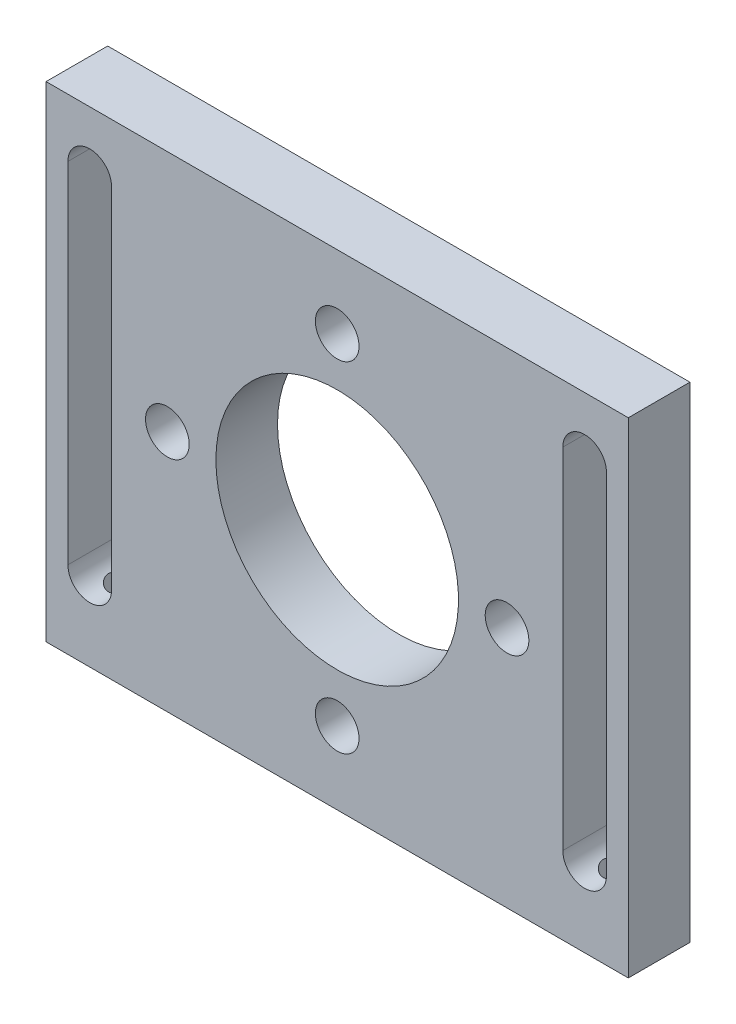
ISO-10303-21;
HEADER;
FILE_DESCRIPTION(('STEP AP214'),'2;1');
FILE_NAME('part.step','',(''),(''),'','','');
FILE_SCHEMA(('AUTOMOTIVE_DESIGN { 1 0 10303 214 1 1 1 1 }'));
ENDSEC;
DATA;
#1=APPLICATION_CONTEXT('core data for automotive mechanical design processes');
#2=APPLICATION_PROTOCOL_DEFINITION('international standard','automotive_design',2000,#1);
#3=PRODUCT_CONTEXT('',#1,'mechanical');
#4=PRODUCT('Part','Part','',(#3));
#5=PRODUCT_RELATED_PRODUCT_CATEGORY('part','',(#4));
#6=PRODUCT_DEFINITION_FORMATION('','',#4);
#7=PRODUCT_DEFINITION_CONTEXT('part definition',#1,'design');
#8=PRODUCT_DEFINITION('design','',#6,#7);
#9=PRODUCT_DEFINITION_SHAPE('','',#8);
#10=(LENGTH_UNIT() NAMED_UNIT(*) SI_UNIT(.MILLI.,.METRE.));
#11=(NAMED_UNIT(*) PLANE_ANGLE_UNIT() SI_UNIT($,.RADIAN.));
#12=(NAMED_UNIT(*) SI_UNIT($,.STERADIAN.) SOLID_ANGLE_UNIT());
#13=UNCERTAINTY_MEASURE_WITH_UNIT(LENGTH_MEASURE(1.E-05),#10,'distance_accuracy_value','');
#14=(GEOMETRIC_REPRESENTATION_CONTEXT(3) GLOBAL_UNCERTAINTY_ASSIGNED_CONTEXT((#13)) GLOBAL_UNIT_ASSIGNED_CONTEXT((#10,
#11,#12)) REPRESENTATION_CONTEXT('',''));
#15=CARTESIAN_POINT('',(0.,0.,0.));
#16=DIRECTION('',(0.,0.,1.));
#17=DIRECTION('',(1.,0.,0.));
#18=AXIS2_PLACEMENT_3D('',#15,#16,#17);
#19=CARTESIAN_POINT('',(30.,25.,6.35));
#20=DIRECTION('',(1.,0.,0.));
#21=DIRECTION('',(0.,1.,0.));
#22=AXIS2_PLACEMENT_3D('',#19,#20,#21);
#23=PLANE('',#22);
#24=DIRECTION('',(0.,-1.,0.));
#25=VECTOR('',#24,1.);
#26=CARTESIAN_POINT('',(30.,25.,0.));
#27=LINE('',#26,#25);
#28=CARTESIAN_POINT('',(30.,25.,0.));
#29=VERTEX_POINT('',#28);
#30=CARTESIAN_POINT('',(30.,-25.,0.));
#31=VERTEX_POINT('',#30);
#32=EDGE_CURVE('E189',#29,#31,#27,.T.);
#33=ORIENTED_EDGE('',*,*,#32,.F.);
#34=DIRECTION('',(0.,0.,-1.));
#35=VECTOR('',#34,1.);
#36=CARTESIAN_POINT('',(30.,25.,6.35));
#37=LINE('',#36,#35);
#38=CARTESIAN_POINT('',(30.,25.,6.35));
#39=VERTEX_POINT('',#38);
#40=EDGE_CURVE('E220',#39,#29,#37,.T.);
#41=ORIENTED_EDGE('',*,*,#40,.F.);
#42=DIRECTION('',(0.,-1.,0.));
#43=VECTOR('',#42,1.);
#44=CARTESIAN_POINT('',(30.,25.,6.35));
#45=LINE('',#44,#43);
#46=CARTESIAN_POINT('',(30.,-25.,6.35));
#47=VERTEX_POINT('',#46);
#48=EDGE_CURVE('E196',#39,#47,#45,.T.);
#49=ORIENTED_EDGE('',*,*,#48,.T.);
#50=DIRECTION('',(0.,0.,-1.));
#51=VECTOR('',#50,1.);
#52=CARTESIAN_POINT('',(30.,-25.,6.35));
#53=LINE('',#52,#51);
#54=EDGE_CURVE('E209',#47,#31,#53,.T.);
#55=ORIENTED_EDGE('',*,*,#54,.T.);
#56=EDGE_LOOP('',(#33,#41,#49,#55));
#57=FACE_BOUND('',#56,.T.);
#58=ADVANCED_FACE('F35',(#57),#23,.T.);
#59=CARTESIAN_POINT('',(-30.,25.,6.35));
#60=DIRECTION('',(0.,1.,0.));
#61=DIRECTION('',(0.,0.,1.));
#62=AXIS2_PLACEMENT_3D('',#59,#60,#61);
#63=PLANE('',#62);
#64=DIRECTION('',(1.,0.,0.));
#65=VECTOR('',#64,1.);
#66=CARTESIAN_POINT('',(-30.,25.,0.));
#67=LINE('',#66,#65);
#68=CARTESIAN_POINT('',(-30.,25.,0.));
#69=VERTEX_POINT('',#68);
#70=EDGE_CURVE('E200',#69,#29,#67,.T.);
#71=ORIENTED_EDGE('',*,*,#70,.F.);
#72=DIRECTION('',(0.,0.,-1.));
#73=VECTOR('',#72,1.);
#74=CARTESIAN_POINT('',(-30.,25.,6.35));
#75=LINE('',#74,#73);
#76=CARTESIAN_POINT('',(-30.,25.,6.35));
#77=VERTEX_POINT('',#76);
#78=EDGE_CURVE('E223',#77,#69,#75,.T.);
#79=ORIENTED_EDGE('',*,*,#78,.F.);
#80=DIRECTION('',(1.,0.,0.));
#81=VECTOR('',#80,1.);
#82=CARTESIAN_POINT('',(-30.,25.,6.35));
#83=LINE('',#82,#81);
#84=EDGE_CURVE('E206',#77,#39,#83,.T.);
#85=ORIENTED_EDGE('',*,*,#84,.T.);
#86=ORIENTED_EDGE('',*,*,#40,.T.);
#87=EDGE_LOOP('',(#71,#79,#85,#86));
#88=FACE_BOUND('',#87,.T.);
#89=ADVANCED_FACE('F264',(#88),#63,.T.);
#90=CARTESIAN_POINT('',(-30.,-25.,6.35));
#91=DIRECTION('',(-1.,0.,0.));
#92=DIRECTION('',(0.,-1.,0.));
#93=AXIS2_PLACEMENT_3D('',#90,#91,#92);
#94=PLANE('',#93);
#95=DIRECTION('',(0.,1.,0.));
#96=VECTOR('',#95,1.);
#97=CARTESIAN_POINT('',(-30.,-25.,0.));
#98=LINE('',#97,#96);
#99=CARTESIAN_POINT('',(-30.,-25.,0.));
#100=VERTEX_POINT('',#99);
#101=EDGE_CURVE('E215',#100,#69,#98,.T.);
#102=ORIENTED_EDGE('',*,*,#101,.F.);
#103=DIRECTION('',(0.,0.,-1.));
#104=VECTOR('',#103,1.);
#105=CARTESIAN_POINT('',(-30.,-25.,6.35));
#106=LINE('',#105,#104);
#107=CARTESIAN_POINT('',(-30.,-25.,6.35));
#108=VERTEX_POINT('',#107);
#109=EDGE_CURVE('E225',#108,#100,#106,.T.);
#110=ORIENTED_EDGE('',*,*,#109,.F.);
#111=DIRECTION('',(0.,1.,0.));
#112=VECTOR('',#111,1.);
#113=CARTESIAN_POINT('',(-30.,-25.,6.35));
#114=LINE('',#113,#112);
#115=EDGE_CURVE('E203',#108,#77,#114,.T.);
#116=ORIENTED_EDGE('',*,*,#115,.T.);
#117=ORIENTED_EDGE('',*,*,#78,.T.);
#118=EDGE_LOOP('',(#102,#110,#116,#117));
#119=FACE_BOUND('',#118,.T.);
#120=ADVANCED_FACE('F270',(#119),#94,.T.);
#121=CARTESIAN_POINT('',(30.,-25.,6.35));
#122=DIRECTION('',(0.,-1.,0.));
#123=DIRECTION('',(0.,0.,-1.));
#124=AXIS2_PLACEMENT_3D('',#121,#122,#123);
#125=PLANE('',#124);
#126=CARTESIAN_POINT('',(25.5,-25.,3.175));
#127=DIRECTION('',(0.,-1.,0.));
#128=DIRECTION('',(0.,0.,-1.));
#129=AXIS2_PLACEMENT_3D('',#126,#127,#128);
#130=CIRCLE('',#129,1.24999999999999);
#131=CARTESIAN_POINT('',(25.5,-25.,1.92500000000001));
#132=VERTEX_POINT('',#131);
#133=EDGE_CURVE('E336',#132,#132,#130,.T.);
#134=ORIENTED_EDGE('',*,*,#133,.F.);
#135=EDGE_LOOP('',(#134));
#136=FACE_BOUND('',#135,.T.);
#137=CARTESIAN_POINT('',(-25.5,-25.,3.175));
#138=DIRECTION('',(0.,-1.,0.));
#139=DIRECTION('',(0.,0.,-1.));
#140=AXIS2_PLACEMENT_3D('',#137,#138,#139);
#141=CIRCLE('',#140,1.24999999999999);
#142=CARTESIAN_POINT('',(-25.5,-25.,1.92500000000001));
#143=VERTEX_POINT('',#142);
#144=EDGE_CURVE('E321',#143,#143,#141,.T.);
#145=ORIENTED_EDGE('',*,*,#144,.F.);
#146=EDGE_LOOP('',(#145));
#147=FACE_BOUND('',#146,.T.);
#148=DIRECTION('',(-1.,0.,0.));
#149=VECTOR('',#148,1.);
#150=CARTESIAN_POINT('',(30.,-25.,0.));
#151=LINE('',#150,#149);
#152=EDGE_CURVE('E212',#31,#100,#151,.T.);
#153=ORIENTED_EDGE('',*,*,#152,.F.);
#154=ORIENTED_EDGE('',*,*,#54,.F.);
#155=DIRECTION('',(-1.,0.,0.));
#156=VECTOR('',#155,1.);
#157=CARTESIAN_POINT('',(30.,-25.,6.35));
#158=LINE('',#157,#156);
#159=EDGE_CURVE('E199',#47,#108,#158,.T.);
#160=ORIENTED_EDGE('',*,*,#159,.T.);
#161=ORIENTED_EDGE('',*,*,#109,.T.);
#162=EDGE_LOOP('',(#153,#154,#160,#161));
#163=FACE_BOUND('',#162,.T.);
#164=ADVANCED_FACE('F276',(#136,#147,#163),#125,.T.);
#165=CARTESIAN_POINT('',(0.,0.,6.35));
#166=DIRECTION('',(0.,0.,-1.));
#167=DIRECTION('',(-1.,0.,0.));
#168=AXIS2_PLACEMENT_3D('',#165,#166,#167);
#169=PLANE('',#168);
#170=CARTESIAN_POINT('',(0.,17.5,6.34999999999999));
#171=DIRECTION('',(0.,0.,-1.));
#172=DIRECTION('',(-1.,0.,0.));
#173=AXIS2_PLACEMENT_3D('',#170,#171,#172);
#174=CIRCLE('',#173,2.24999999999999);
#175=CARTESIAN_POINT('',(-2.24999999999999,17.5,6.34999999999999));
#176=VERTEX_POINT('',#175);
#177=EDGE_CURVE('E311',#176,#176,#174,.T.);
#178=ORIENTED_EDGE('',*,*,#177,.T.);
#179=EDGE_LOOP('',(#178));
#180=FACE_BOUND('',#179,.T.);
#181=CARTESIAN_POINT('',(-17.5000000000005,4.95236783133562E-13,6.34999999999999));
#182=DIRECTION('',(0.,0.,-1.));
#183=DIRECTION('',(-1.,0.,0.));
#184=AXIS2_PLACEMENT_3D('',#181,#182,#183);
#185=CIRCLE('',#184,2.24999999999999);
#186=CARTESIAN_POINT('',(-19.7500000000005,4.95236783133562E-13,6.34999999999999));
#187=VERTEX_POINT('',#186);
#188=EDGE_CURVE('E306',#187,#187,#185,.T.);
#189=ORIENTED_EDGE('',*,*,#188,.T.);
#190=EDGE_LOOP('',(#189));
#191=FACE_BOUND('',#190,.T.);
#192=CARTESIAN_POINT('',(-9.90473566267125E-13,-17.5,6.34999999999999));
#193=DIRECTION('',(0.,0.,-1.));
#194=DIRECTION('',(-1.,0.,0.));
#195=AXIS2_PLACEMENT_3D('',#192,#193,#194);
#196=CIRCLE('',#195,2.24999999999999);
#197=CARTESIAN_POINT('',(-2.25000000000098,-17.5,6.34999999999999));
#198=VERTEX_POINT('',#197);
#199=EDGE_CURVE('E302',#198,#198,#196,.T.);
#200=ORIENTED_EDGE('',*,*,#199,.T.);
#201=EDGE_LOOP('',(#200));
#202=FACE_BOUND('',#201,.T.);
#203=CARTESIAN_POINT('',(17.4999999999995,-4.93093651235055E-13,6.34999999999999));
#204=DIRECTION('',(0.,0.,-1.));
#205=DIRECTION('',(-1.,0.,0.));
#206=AXIS2_PLACEMENT_3D('',#203,#204,#205);
#207=CIRCLE('',#206,2.24999999999999);
#208=CARTESIAN_POINT('',(15.2499999999995,-4.93093651235055E-13,6.34999999999999));
#209=VERTEX_POINT('',#208);
#210=EDGE_CURVE('E299',#209,#209,#207,.T.);
#211=ORIENTED_EDGE('',*,*,#210,.T.);
#212=EDGE_LOOP('',(#211));
#213=FACE_BOUND('',#212,.T.);
#214=CARTESIAN_POINT('',(-1.11022302462516E-13,-1.11022302462516E-13,6.34999999999999));
#215=DIRECTION('',(0.,0.,-1.));
#216=DIRECTION('',(-1.,0.,0.));
#217=AXIS2_PLACEMENT_3D('',#214,#215,#216);
#218=CIRCLE('',#217,12.5000000000001);
#219=CARTESIAN_POINT('',(-12.5000000000002,-1.11022302462516E-13,6.34999999999999));
#220=VERTEX_POINT('',#219);
#221=EDGE_CURVE('E148',#220,#220,#218,.T.);
#222=ORIENTED_EDGE('',*,*,#221,.T.);
#223=EDGE_LOOP('',(#222));
#224=FACE_BOUND('',#223,.T.);
#225=DIRECTION('',(0.,1.,0.));
#226=VECTOR('',#225,1.);
#227=CARTESIAN_POINT('',(27.75,-17.,6.35));
#228=LINE('',#227,#226);
#229=CARTESIAN_POINT('',(27.75,-17.,6.35));
#230=VERTEX_POINT('',#229);
#231=CARTESIAN_POINT('',(27.75,19.,6.35));
#232=VERTEX_POINT('',#231);
#233=EDGE_CURVE('E154',#230,#232,#228,.T.);
#234=ORIENTED_EDGE('',*,*,#233,.F.);
#235=CARTESIAN_POINT('',(25.5,-17.,6.35));
#236=DIRECTION('',(0.,0.,1.));
#237=DIRECTION('',(1.,0.,0.));
#238=AXIS2_PLACEMENT_3D('',#235,#236,#237);
#239=CIRCLE('',#238,2.24999999999999);
#240=CARTESIAN_POINT('',(23.25,-17.,6.35));
#241=VERTEX_POINT('',#240);
#242=EDGE_CURVE('E50',#241,#230,#239,.T.);
#243=ORIENTED_EDGE('',*,*,#242,.F.);
#244=DIRECTION('',(0.,-1.,0.));
#245=VECTOR('',#244,1.);
#246=CARTESIAN_POINT('',(23.25,19.,6.35));
#247=LINE('',#246,#245);
#248=CARTESIAN_POINT('',(23.25,19.,6.35));
#249=VERTEX_POINT('',#248);
#250=EDGE_CURVE('E142',#249,#241,#247,.T.);
#251=ORIENTED_EDGE('',*,*,#250,.F.);
#252=CARTESIAN_POINT('',(25.5,19.,6.35));
#253=DIRECTION('',(0.,0.,1.));
#254=DIRECTION('',(1.,0.,0.));
#255=AXIS2_PLACEMENT_3D('',#252,#253,#254);
#256=CIRCLE('',#255,2.25);
#257=EDGE_CURVE('E145',#232,#249,#256,.T.);
#258=ORIENTED_EDGE('',*,*,#257,.F.);
#259=EDGE_LOOP('',(#234,#243,#251,#258));
#260=FACE_BOUND('',#259,.T.);
#261=DIRECTION('',(0.,1.,0.));
#262=VECTOR('',#261,1.);
#263=CARTESIAN_POINT('',(-27.75,-17.,6.35));
#264=LINE('',#263,#262);
#265=CARTESIAN_POINT('',(-27.75,-17.,6.35));
#266=VERTEX_POINT('',#265);
#267=CARTESIAN_POINT('',(-27.75,19.,6.35));
#268=VERTEX_POINT('',#267);
#269=EDGE_CURVE('E174',#266,#268,#264,.T.);
#270=ORIENTED_EDGE('',*,*,#269,.T.);
#271=CARTESIAN_POINT('',(-25.5,19.,6.35));
#272=DIRECTION('',(0.,0.,-1.));
#273=DIRECTION('',(-1.,0.,0.));
#274=AXIS2_PLACEMENT_3D('',#271,#272,#273);
#275=CIRCLE('',#274,2.25);
#276=CARTESIAN_POINT('',(-23.25,19.,6.35));
#277=VERTEX_POINT('',#276);
#278=EDGE_CURVE('E164',#268,#277,#275,.T.);
#279=ORIENTED_EDGE('',*,*,#278,.T.);
#280=DIRECTION('',(0.,-1.,0.));
#281=VECTOR('',#280,1.);
#282=CARTESIAN_POINT('',(-23.25,19.,6.35));
#283=LINE('',#282,#281);
#284=CARTESIAN_POINT('',(-23.25,-17.,6.35));
#285=VERTEX_POINT('',#284);
#286=EDGE_CURVE('E167',#277,#285,#283,.T.);
#287=ORIENTED_EDGE('',*,*,#286,.T.);
#288=CARTESIAN_POINT('',(-25.5,-17.,6.35));
#289=DIRECTION('',(0.,0.,-1.));
#290=DIRECTION('',(-1.,0.,0.));
#291=AXIS2_PLACEMENT_3D('',#288,#289,#290);
#292=CIRCLE('',#291,2.24999999999999);
#293=EDGE_CURVE('E171',#285,#266,#292,.T.);
#294=ORIENTED_EDGE('',*,*,#293,.T.);
#295=EDGE_LOOP('',(#270,#279,#287,#294));
#296=FACE_BOUND('',#295,.T.);
#297=ORIENTED_EDGE('',*,*,#48,.F.);
#298=ORIENTED_EDGE('',*,*,#84,.F.);
#299=ORIENTED_EDGE('',*,*,#115,.F.);
#300=ORIENTED_EDGE('',*,*,#159,.F.);
#301=EDGE_LOOP('',(#297,#298,#299,#300));
#302=FACE_BOUND('',#301,.T.);
#303=ADVANCED_FACE('F343',(#180,#191,#202,#213,#224,#260,#296,#302),#169,.F.);
#304=CARTESIAN_POINT('',(0.,0.,0.));
#305=DIRECTION('',(0.,0.,-1.));
#306=DIRECTION('',(-1.,0.,0.));
#307=AXIS2_PLACEMENT_3D('',#304,#305,#306);
#308=PLANE('',#307);
#309=CARTESIAN_POINT('',(17.4999999999995,-4.93093651235055E-13,0.));
#310=DIRECTION('',(0.,0.,-1.));
#311=DIRECTION('',(-1.,0.,0.));
#312=AXIS2_PLACEMENT_3D('',#309,#310,#311);
#313=CIRCLE('',#312,4.69999999997033);
#314=CARTESIAN_POINT('',(12.8000000000292,-4.93093651235055E-13,0.));
#315=VERTEX_POINT('',#314);
#316=EDGE_CURVE('E239',#315,#315,#313,.F.);
#317=ORIENTED_EDGE('',*,*,#316,.T.);
#318=EDGE_LOOP('',(#317));
#319=FACE_BOUND('',#318,.T.);
#320=CARTESIAN_POINT('',(-9.90473566267125E-13,-17.5,0.));
#321=DIRECTION('',(0.,0.,-1.));
#322=DIRECTION('',(-1.,0.,0.));
#323=AXIS2_PLACEMENT_3D('',#320,#321,#322);
#324=CIRCLE('',#323,4.69999999997033);
#325=CARTESIAN_POINT('',(-4.69999999997132,-17.5,0.));
#326=VERTEX_POINT('',#325);
#327=EDGE_CURVE('E236',#326,#326,#324,.F.);
#328=ORIENTED_EDGE('',*,*,#327,.T.);
#329=EDGE_LOOP('',(#328));
#330=FACE_BOUND('',#329,.T.);
#331=CARTESIAN_POINT('',(0.,17.5,0.));
#332=DIRECTION('',(0.,0.,-1.));
#333=DIRECTION('',(-1.,0.,0.));
#334=AXIS2_PLACEMENT_3D('',#331,#332,#333);
#335=CIRCLE('',#334,4.69999999997033);
#336=CARTESIAN_POINT('',(-4.69999999997033,17.5,0.));
#337=VERTEX_POINT('',#336);
#338=EDGE_CURVE('E233',#337,#337,#335,.F.);
#339=ORIENTED_EDGE('',*,*,#338,.T.);
#340=EDGE_LOOP('',(#339));
#341=FACE_BOUND('',#340,.T.);
#342=CARTESIAN_POINT('',(-17.5000000000005,4.95236783133562E-13,0.));
#343=DIRECTION('',(0.,0.,-1.));
#344=DIRECTION('',(-1.,0.,0.));
#345=AXIS2_PLACEMENT_3D('',#342,#343,#344);
#346=CIRCLE('',#345,4.69999999997033);
#347=CARTESIAN_POINT('',(-22.1999999999708,4.95236783133562E-13,0.));
#348=VERTEX_POINT('',#347);
#349=EDGE_CURVE('E230',#348,#348,#346,.F.);
#350=ORIENTED_EDGE('',*,*,#349,.T.);
#351=EDGE_LOOP('',(#350));
#352=FACE_BOUND('',#351,.T.);
#353=CARTESIAN_POINT('',(-1.11022302462516E-13,-1.11022302462516E-13,0.));
#354=DIRECTION('',(0.,0.,-1.));
#355=DIRECTION('',(-1.,0.,0.));
#356=AXIS2_PLACEMENT_3D('',#353,#354,#355);
#357=CIRCLE('',#356,12.5000000000001);
#358=CARTESIAN_POINT('',(-12.5000000000002,-1.11022302462516E-13,0.));
#359=VERTEX_POINT('',#358);
#360=EDGE_CURVE('E301',#359,#359,#357,.T.);
#361=ORIENTED_EDGE('',*,*,#360,.F.);
#362=EDGE_LOOP('',(#361));
#363=FACE_BOUND('',#362,.T.);
#364=CARTESIAN_POINT('',(25.5,-17.,0.));
#365=DIRECTION('',(0.,0.,1.));
#366=DIRECTION('',(1.,0.,0.));
#367=AXIS2_PLACEMENT_3D('',#364,#365,#366);
#368=CIRCLE('',#367,2.24999999999999);
#369=CARTESIAN_POINT('',(23.25,-17.,0.));
#370=VERTEX_POINT('',#369);
#371=CARTESIAN_POINT('',(27.75,-17.,0.));
#372=VERTEX_POINT('',#371);
#373=EDGE_CURVE('E126',#370,#372,#368,.T.);
#374=ORIENTED_EDGE('',*,*,#373,.T.);
#375=DIRECTION('',(0.,1.,0.));
#376=VECTOR('',#375,1.);
#377=CARTESIAN_POINT('',(27.75,-17.,0.));
#378=LINE('',#377,#376);
#379=CARTESIAN_POINT('',(27.75,19.,0.));
#380=VERTEX_POINT('',#379);
#381=EDGE_CURVE('E135',#372,#380,#378,.T.);
#382=ORIENTED_EDGE('',*,*,#381,.T.);
#383=CARTESIAN_POINT('',(25.5,19.,0.));
#384=DIRECTION('',(0.,0.,1.));
#385=DIRECTION('',(1.,0.,0.));
#386=AXIS2_PLACEMENT_3D('',#383,#384,#385);
#387=CIRCLE('',#386,2.25);
#388=CARTESIAN_POINT('',(23.25,19.,0.));
#389=VERTEX_POINT('',#388);
#390=EDGE_CURVE('E58',#380,#389,#387,.T.);
#391=ORIENTED_EDGE('',*,*,#390,.T.);
#392=DIRECTION('',(0.,-1.,0.));
#393=VECTOR('',#392,1.);
#394=CARTESIAN_POINT('',(23.25,19.,0.));
#395=LINE('',#394,#393);
#396=EDGE_CURVE('E132',#389,#370,#395,.T.);
#397=ORIENTED_EDGE('',*,*,#396,.T.);
#398=EDGE_LOOP('',(#374,#382,#391,#397));
#399=FACE_BOUND('',#398,.T.);
#400=CARTESIAN_POINT('',(-25.5,19.,0.));
#401=DIRECTION('',(0.,0.,-1.));
#402=DIRECTION('',(-1.,0.,0.));
#403=AXIS2_PLACEMENT_3D('',#400,#401,#402);
#404=CIRCLE('',#403,2.25);
#405=CARTESIAN_POINT('',(-27.75,19.,0.));
#406=VERTEX_POINT('',#405);
#407=CARTESIAN_POINT('',(-23.25,19.,0.));
#408=VERTEX_POINT('',#407);
#409=EDGE_CURVE('E160',#406,#408,#404,.T.);
#410=ORIENTED_EDGE('',*,*,#409,.F.);
#411=DIRECTION('',(0.,1.,0.));
#412=VECTOR('',#411,1.);
#413=CARTESIAN_POINT('',(-27.75,-17.,0.));
#414=LINE('',#413,#412);
#415=CARTESIAN_POINT('',(-27.75,-17.,0.));
#416=VERTEX_POINT('',#415);
#417=EDGE_CURVE('E168',#416,#406,#414,.T.);
#418=ORIENTED_EDGE('',*,*,#417,.F.);
#419=CARTESIAN_POINT('',(-25.5,-17.,0.));
#420=DIRECTION('',(0.,0.,-1.));
#421=DIRECTION('',(-1.,0.,0.));
#422=AXIS2_PLACEMENT_3D('',#419,#420,#421);
#423=CIRCLE('',#422,2.24999999999999);
#424=CARTESIAN_POINT('',(-23.25,-17.,0.));
#425=VERTEX_POINT('',#424);
#426=EDGE_CURVE('E182',#425,#416,#423,.T.);
#427=ORIENTED_EDGE('',*,*,#426,.F.);
#428=DIRECTION('',(0.,-1.,0.));
#429=VECTOR('',#428,1.);
#430=CARTESIAN_POINT('',(-23.25,19.,0.));
#431=LINE('',#430,#429);
#432=EDGE_CURVE('E179',#408,#425,#431,.T.);
#433=ORIENTED_EDGE('',*,*,#432,.F.);
#434=EDGE_LOOP('',(#410,#418,#427,#433));
#435=FACE_BOUND('',#434,.T.);
#436=ORIENTED_EDGE('',*,*,#32,.T.);
#437=ORIENTED_EDGE('',*,*,#152,.T.);
#438=ORIENTED_EDGE('',*,*,#101,.T.);
#439=ORIENTED_EDGE('',*,*,#70,.T.);
#440=EDGE_LOOP('',(#436,#437,#438,#439));
#441=FACE_BOUND('',#440,.T.);
#442=ADVANCED_FACE('F139',(#319,#330,#341,#352,#363,#399,#435,#441),#308,.T.);
#443=CARTESIAN_POINT('',(-25.5,19.,6.35));
#444=DIRECTION('',(0.,0.,-1.));
#445=DIRECTION('',(-1.,0.,0.));
#446=AXIS2_PLACEMENT_3D('',#443,#444,#445);
#447=CYLINDRICAL_SURFACE('',#446,2.25);
#448=ORIENTED_EDGE('',*,*,#409,.T.);
#449=DIRECTION('',(0.,0.,-1.));
#450=VECTOR('',#449,1.);
#451=CARTESIAN_POINT('',(-23.25,19.,6.35));
#452=LINE('',#451,#450);
#453=EDGE_CURVE('E177',#277,#408,#452,.T.);
#454=ORIENTED_EDGE('',*,*,#453,.F.);
#455=ORIENTED_EDGE('',*,*,#278,.F.);
#456=DIRECTION('',(0.,0.,-1.));
#457=VECTOR('',#456,1.);
#458=CARTESIAN_POINT('',(-27.75,19.,6.35));
#459=LINE('',#458,#457);
#460=EDGE_CURVE('E187',#268,#406,#459,.T.);
#461=ORIENTED_EDGE('',*,*,#460,.T.);
#462=EDGE_LOOP('',(#448,#454,#455,#461));
#463=FACE_BOUND('',#462,.T.);
#464=ADVANCED_FACE('F363',(#463),#447,.F.);
#465=CARTESIAN_POINT('',(-27.75,-17.,6.35));
#466=DIRECTION('',(-1.,0.,0.));
#467=DIRECTION('',(0.,0.,1.));
#468=AXIS2_PLACEMENT_3D('',#465,#466,#467);
#469=PLANE('',#468);
#470=ORIENTED_EDGE('',*,*,#417,.T.);
#471=ORIENTED_EDGE('',*,*,#460,.F.);
#472=ORIENTED_EDGE('',*,*,#269,.F.);
#473=DIRECTION('',(0.,0.,-1.));
#474=VECTOR('',#473,1.);
#475=CARTESIAN_POINT('',(-27.75,-17.,6.35));
#476=LINE('',#475,#474);
#477=EDGE_CURVE('E190',#266,#416,#476,.T.);
#478=ORIENTED_EDGE('',*,*,#477,.T.);
#479=EDGE_LOOP('',(#470,#471,#472,#478));
#480=FACE_BOUND('',#479,.T.);
#481=ADVANCED_FACE('F370',(#480),#469,.F.);
#482=CARTESIAN_POINT('',(-25.5,-17.,6.35));
#483=DIRECTION('',(0.,0.,-1.));
#484=DIRECTION('',(-1.,0.,0.));
#485=AXIS2_PLACEMENT_3D('',#482,#483,#484);
#486=CYLINDRICAL_SURFACE('',#485,2.24999999999999);
#487=CARTESIAN_POINT('',(-25.5,-19.25,1.92500000000001));
#488=CARTESIAN_POINT('',(-25.4351209548962,-19.2500015723267,1.92499816740441));
#489=CARTESIAN_POINT('',(-25.3702524759768,-19.2471698495017,1.93007328517846));
#490=CARTESIAN_POINT('',(-25.2425319528804,-19.2361396538124,1.95009593073591));
#491=CARTESIAN_POINT('',(-25.1796802851913,-19.227940184969,1.96504529067823));
#492=CARTESIAN_POINT('',(-25.0579563315292,-19.2070121352988,2.00403007853263));
#493=CARTESIAN_POINT('',(-24.9990703520008,-19.1943002029893,2.02803212706117));
#494=CARTESIAN_POINT('',(-24.8862701412099,-19.1654628853509,2.08421583443204));
#495=CARTESIAN_POINT('',(-24.8323571088202,-19.1493366799843,2.11639945869263));
#496=CARTESIAN_POINT('',(-24.726831924282,-19.1137699071885,2.19054334125147));
#497=CARTESIAN_POINT('',(-24.6756404722195,-19.094176844105,2.23302782386941));
#498=CARTESIAN_POINT('',(-24.5807059862036,-19.0542773672776,2.32541633368337));
#499=CARTESIAN_POINT('',(-24.5369705594103,-19.0339702501784,2.37532784239141));
#500=CARTESIAN_POINT('',(-24.4537146804888,-18.9925262319752,2.48715760511563));
#501=CARTESIAN_POINT('',(-24.4150705893268,-18.9715138059636,2.54978005060354));
#502=CARTESIAN_POINT('',(-24.3490315869242,-18.9337084530971,2.68184569563726));
#503=CARTESIAN_POINT('',(-24.3216205709157,-18.9169094989322,2.75127895219248));
#504=CARTESIAN_POINT('',(-24.2838589008397,-18.8931165088077,2.88002861147382));
#505=CARTESIAN_POINT('',(-24.2711336088253,-18.8848038835762,2.93840483929615));
#506=CARTESIAN_POINT('',(-24.254160645296,-18.8736308253758,3.05686781955793));
#507=CARTESIAN_POINT('',(-24.2499046171217,-18.8707650181334,3.11695282648604));
#508=CARTESIAN_POINT('',(-24.2500987738263,-18.8708946342506,3.23716554758626));
#509=CARTESIAN_POINT('',(-24.2545584922971,-18.8738964758527,3.29729323652846));
#510=CARTESIAN_POINT('',(-24.2719477604276,-18.8853359825927,3.41578896920021));
#511=CARTESIAN_POINT('',(-24.2848828175938,-18.8937771823148,3.47415584288779));
#512=CARTESIAN_POINT('',(-24.3186117464533,-18.9149971209608,3.58771612399658));
#513=CARTESIAN_POINT('',(-24.3394073654019,-18.9277768241881,3.64290882271337));
#514=CARTESIAN_POINT('',(-24.3881487157813,-18.9562930306086,3.74920376192739));
#515=CARTESIAN_POINT('',(-24.4160972398671,-18.9720306880147,3.80030439453621));
#516=CARTESIAN_POINT('',(-24.4832678253128,-19.0075874826177,3.9052066476696));
#517=CARTESIAN_POINT('',(-24.5235576469465,-19.0276634258412,3.95823862670866));
#518=CARTESIAN_POINT('',(-24.6120158739858,-19.0679334673907,4.0572684763165));
#519=CARTESIAN_POINT('',(-24.6601904969501,-19.0881276467356,4.10326073988032));
#520=CARTESIAN_POINT('',(-24.7689304991533,-19.1287870455705,4.19157447515284));
#521=CARTESIAN_POINT('',(-24.8302569194643,-19.149072188726,4.23305109606081));
#522=CARTESIAN_POINT('',(-24.960260986938,-19.1853427752959,4.30490527437183));
#523=CARTESIAN_POINT('',(-25.0289337564396,-19.2013310471802,4.3352901378082));
#524=CARTESIAN_POINT('',(-25.1666259869222,-19.2261854674445,4.38175541792631));
#525=CARTESIAN_POINT('',(-25.2352755578347,-19.2354762547661,4.39869738469538));
#526=CARTESIAN_POINT('',(-25.3749879065163,-19.2476148061201,4.42073685262216));
#527=CARTESIAN_POINT('',(-25.4460484965173,-19.2504682606717,4.42584481499534));
#528=CARTESIAN_POINT('',(-25.5798684960307,-19.2494639570856,4.4240333905764));
#529=CARTESIAN_POINT('',(-25.6426558778569,-19.2463302252997,4.41841162577032));
#530=CARTESIAN_POINT('',(-25.766230694671,-19.2350548029049,4.39792407134506));
#531=CARTESIAN_POINT('',(-25.8270180646012,-19.2269129495579,4.38305798133288));
#532=CARTESIAN_POINT('',(-25.9448130210737,-19.206401474865,4.34481434480667));
#533=CARTESIAN_POINT('',(-26.0018336375591,-19.1940474493538,4.32146817578071));
#534=CARTESIAN_POINT('',(-26.111212244299,-19.1661278759621,4.26708690882508));
#535=CARTESIAN_POINT('',(-26.1635689817317,-19.1505614688665,4.23604975334168));
#536=CARTESIAN_POINT('',(-26.2679354105119,-19.1156809210964,4.1635439040816));
#537=CARTESIAN_POINT('',(-26.3193527685384,-19.0961458529043,4.12132962390589));
#538=CARTESIAN_POINT('',(-26.4147695698292,-19.0563015860909,4.02945346339166));
#539=CARTESIAN_POINT('',(-26.4587607471526,-19.0359915552907,3.97978339878615));
#540=CARTESIAN_POINT('',(-26.5425598073516,-18.9944843116866,3.86846917619265));
#541=CARTESIAN_POINT('',(-26.5815000784041,-18.9734037776624,3.80612286623772));
#542=CARTESIAN_POINT('',(-26.648189663038,-18.9353663139667,3.67457767081017));
#543=CARTESIAN_POINT('',(-26.6759548047087,-18.9184035656181,3.60538865151106));
#544=CARTESIAN_POINT('',(-26.7144444488386,-18.8942095223585,3.47689151494468));
#545=CARTESIAN_POINT('',(-26.7275144306994,-18.8856868621662,3.41852936383199));
#546=CARTESIAN_POINT('',(-26.7451696286077,-18.8740782279343,3.30002668132841));
#547=CARTESIAN_POINT('',(-26.7497633199199,-18.8709868234446,3.23988798747959));
#548=CARTESIAN_POINT('',(-26.7502190954589,-18.8706823124973,3.11948912143443));
#549=CARTESIAN_POINT('',(-26.7460703095224,-18.873476524056,3.05922889118885));
#550=CARTESIAN_POINT('',(-26.7292582158663,-18.8845480482418,2.94041600736518));
#551=CARTESIAN_POINT('',(-26.7165894710623,-18.8928288621409,2.88186446911444));
#552=CARTESIAN_POINT('',(-26.6833974160283,-18.9137526719087,2.76809056729007));
#553=CARTESIAN_POINT('',(-26.6628978363351,-18.9263824773188,2.71285872332491));
#554=CARTESIAN_POINT('',(-26.6147472101062,-18.9546396874383,2.60644585823974));
#555=CARTESIAN_POINT('',(-26.5870934087331,-18.9702682462613,2.55526640748974));
#556=CARTESIAN_POINT('',(-26.5205963127424,-19.005617944973,2.45021885371193));
#557=CARTESIAN_POINT('',(-26.4806948125274,-19.0256009088526,2.39710779350179));
#558=CARTESIAN_POINT('',(-26.3930296551658,-19.0657505338035,2.29785244098253));
#559=CARTESIAN_POINT('',(-26.3452596468467,-19.0859173307333,2.25171383474651));
#560=CARTESIAN_POINT('',(-26.2372393312335,-19.1266506088251,2.16289367606591));
#561=CARTESIAN_POINT('',(-26.176207464624,-19.1470401013464,2.121072177107));
#562=CARTESIAN_POINT('',(-26.0467457068315,-19.1835932885934,2.04847246759611));
#563=CARTESIAN_POINT('',(-25.978321260542,-19.1997600639052,2.01768620040522));
#564=CARTESIAN_POINT('',(-25.8424116138035,-19.2247670410903,1.97086428099732));
#565=CARTESIAN_POINT('',(-25.7753983052574,-19.2341365307186,1.95374867593119));
#566=CARTESIAN_POINT('',(-25.6389179844763,-19.2467497691602,1.93082194429777));
#567=CARTESIAN_POINT('',(-25.5694529379855,-19.2499983168262,1.92500196179134));
#568=CARTESIAN_POINT('',(-25.5,-19.25,1.92500000000001));
#569=B_SPLINE_CURVE_WITH_KNOTS('',3,(#487,#488,#489,#490,#491,#492,#493,#494,#495,#496,#497,
#498,#499,#500,#501,#502,#503,#504,#505,#506,#507,#508,#509,#510,#511,#512,#513,#514,#515,#516,
#517,#518,#519,#520,#521,#522,#523,#524,#525,#526,#527,#528,#529,#530,#531,#532,#533,#534,#535,
#536,#537,#538,#539,#540,#541,#542,#543,#544,#545,#546,#547,#548,#549,#550,#551,#552,#553,#554,
#555,#556,#557,#558,#559,#560,#561,#562,#563,#564,#565,#566,#567,#568),.UNSPECIFIED.,.T.,.F.,(4,
2,2,2,2,2,2,2,2,2,2,2,2,2,2,2,2,2,2,2,2,2,2,2,2,2,2,2,2,2,2,2,2,2,2,2,2,2,2,2,4),(0.,
0.194367775453666,0.388771625851,0.582465562390231,0.776206073079426,0.983418974758901,
1.19084204050846,1.41928633568446,1.64740195656088,1.82758088324604,2.00758193827362,
2.18777999502582,2.36809526568402,2.54845064063289,2.72887653808107,2.93672102222228,
3.14473019879253,3.37382737504413,3.60277337373989,3.81548472480841,4.02800796797491,
4.21644267533275,4.40488350616916,4.59263406608554,4.78043490885184,4.98759837529248,
5.19499093239248,5.42327208530796,5.65122876070612,5.83167651998363,6.01194375536384,
6.19243526246238,6.37304206118931,6.55310583659664,6.73323905165346,6.94051710203252,
7.14796328700574,7.37700746031109,7.60588407003813,7.81411785909668,8.02218832365682),.UNSPECIFIED.);
#570=CARTESIAN_POINT('',(-25.5,-19.25,1.92500000000001));
#571=VERTEX_POINT('',#570);
#572=EDGE_CURVE('E314',#571,#571,#569,.T.);
#573=ORIENTED_EDGE('',*,*,#572,.T.);
#574=EDGE_LOOP('',(#573));
#575=FACE_BOUND('',#574,.T.);
#576=ORIENTED_EDGE('',*,*,#426,.T.);
#577=ORIENTED_EDGE('',*,*,#477,.F.);
#578=ORIENTED_EDGE('',*,*,#293,.F.);
#579=DIRECTION('',(0.,0.,-1.));
#580=VECTOR('',#579,1.);
#581=CARTESIAN_POINT('',(-23.25,-17.,6.35));
#582=LINE('',#581,#580);
#583=EDGE_CURVE('E192',#285,#425,#582,.T.);
#584=ORIENTED_EDGE('',*,*,#583,.T.);
#585=EDGE_LOOP('',(#576,#577,#578,#584));
#586=FACE_BOUND('',#585,.T.);
#587=ADVANCED_FACE('F375',(#575,#586),#486,.F.);
#588=CARTESIAN_POINT('',(-23.25,19.,6.35));
#589=DIRECTION('',(1.,0.,0.));
#590=DIRECTION('',(0.,1.,0.));
#591=AXIS2_PLACEMENT_3D('',#588,#589,#590);
#592=PLANE('',#591);
#593=ORIENTED_EDGE('',*,*,#432,.T.);
#594=ORIENTED_EDGE('',*,*,#583,.F.);
#595=ORIENTED_EDGE('',*,*,#286,.F.);
#596=ORIENTED_EDGE('',*,*,#453,.T.);
#597=EDGE_LOOP('',(#593,#594,#595,#596));
#598=FACE_BOUND('',#597,.T.);
#599=ADVANCED_FACE('F372',(#598),#592,.F.);
#600=CARTESIAN_POINT('',(25.5,-17.,0.));
#601=DIRECTION('',(0.,0.,1.));
#602=DIRECTION('',(1.,0.,0.));
#603=AXIS2_PLACEMENT_3D('',#600,#601,#602);
#604=CYLINDRICAL_SURFACE('',#603,2.24999999999999);
#605=CARTESIAN_POINT('',(25.5,-19.25,1.92500000000001));
#606=CARTESIAN_POINT('',(25.5648790451039,-19.2500015723266,1.92499816740441));
#607=CARTESIAN_POINT('',(25.6297475240232,-19.2471698495017,1.93007328517846));
#608=CARTESIAN_POINT('',(25.7574680471196,-19.2361396538124,1.95009593073591));
#609=CARTESIAN_POINT('',(25.8203197148087,-19.227940184969,1.96504529067823));
#610=CARTESIAN_POINT('',(25.9420436684708,-19.2070121352988,2.00403007853263));
#611=CARTESIAN_POINT('',(26.0009296479992,-19.1943002029893,2.02803212706117));
#612=CARTESIAN_POINT('',(26.1137298587901,-19.1654628853509,2.08421583443204));
#613=CARTESIAN_POINT('',(26.1676428911798,-19.1493366799843,2.11639945869264));
#614=CARTESIAN_POINT('',(26.273168075718,-19.1137699071885,2.19054334125147));
#615=CARTESIAN_POINT('',(26.3243595277805,-19.094176844105,2.23302782386941));
#616=CARTESIAN_POINT('',(26.4192940137964,-19.0542773672776,2.32541633368337));
#617=CARTESIAN_POINT('',(26.4630294405897,-19.0339702501784,2.37532784239141));
#618=CARTESIAN_POINT('',(26.5462853195112,-18.9925262319752,2.48715760511563));
#619=CARTESIAN_POINT('',(26.5849294106732,-18.9715138059636,2.54978005060354));
#620=CARTESIAN_POINT('',(26.6509684130759,-18.9337084530971,2.68184569563727));
#621=CARTESIAN_POINT('',(26.6783794290843,-18.9169094989322,2.75127895219248));
#622=CARTESIAN_POINT('',(26.7161410991603,-18.8931165088077,2.88002861147382));
#623=CARTESIAN_POINT('',(26.7288663911747,-18.8848038835762,2.93840483929615));
#624=CARTESIAN_POINT('',(26.745839354704,-18.8736308253758,3.05686781955793));
#625=CARTESIAN_POINT('',(26.7500953828783,-18.8707650181334,3.11695282648604));
#626=CARTESIAN_POINT('',(26.7499012261737,-18.8708946342505,3.23716554758626));
#627=CARTESIAN_POINT('',(26.7454415077029,-18.8738964758527,3.29729323652846));
#628=CARTESIAN_POINT('',(26.7280522395724,-18.8853359825926,3.41578896920021));
#629=CARTESIAN_POINT('',(26.7151171824062,-18.8937771823148,3.47415584288779));
#630=CARTESIAN_POINT('',(26.6813882535467,-18.9149971209608,3.58771612399658));
#631=CARTESIAN_POINT('',(26.6605926345981,-18.9277768241881,3.64290882271338));
#632=CARTESIAN_POINT('',(26.6118512842187,-18.9562930306085,3.74920376192739));
#633=CARTESIAN_POINT('',(26.5839027601329,-18.9720306880147,3.80030439453621));
#634=CARTESIAN_POINT('',(26.5167321746872,-19.0075874826177,3.9052066476696));
#635=CARTESIAN_POINT('',(26.4764423530535,-19.0276634258412,3.95823862670865));
#636=CARTESIAN_POINT('',(26.3879841260142,-19.0679334673907,4.0572684763165));
#637=CARTESIAN_POINT('',(26.3398095030499,-19.0881276467356,4.10326073988032));
#638=CARTESIAN_POINT('',(26.2310695008467,-19.1287870455705,4.19157447515284));
#639=CARTESIAN_POINT('',(26.1697430805357,-19.149072188726,4.23305109606081));
#640=CARTESIAN_POINT('',(26.039739013062,-19.1853427752959,4.30490527437183));
#641=CARTESIAN_POINT('',(25.9710662435604,-19.2013310471802,4.3352901378082));
#642=CARTESIAN_POINT('',(25.8333740130778,-19.2261854674445,4.38175541792631));
#643=CARTESIAN_POINT('',(25.7647244421653,-19.2354762547661,4.39869738469538));
#644=CARTESIAN_POINT('',(25.6250120934837,-19.2476148061201,4.42073685262216));
#645=CARTESIAN_POINT('',(25.5539515034827,-19.2504682606717,4.42584481499534));
#646=CARTESIAN_POINT('',(25.4201315039693,-19.2494639570856,4.4240333905764));
#647=CARTESIAN_POINT('',(25.3573441221431,-19.2463302252997,4.41841162577032));
#648=CARTESIAN_POINT('',(25.233769305329,-19.2350548029049,4.39792407134506));
#649=CARTESIAN_POINT('',(25.1729819353988,-19.2269129495579,4.38305798133288));
#650=CARTESIAN_POINT('',(25.0551869789263,-19.206401474865,4.34481434480667));
#651=CARTESIAN_POINT('',(24.9981663624409,-19.1940474493538,4.32146817578071));
#652=CARTESIAN_POINT('',(24.888787755701,-19.1661278759621,4.26708690882508));
#653=CARTESIAN_POINT('',(24.8364310182683,-19.1505614688665,4.23604975334168));
#654=CARTESIAN_POINT('',(24.7320645894881,-19.1156809210964,4.1635439040816));
#655=CARTESIAN_POINT('',(24.6806472314617,-19.0961458529043,4.12132962390589));
#656=CARTESIAN_POINT('',(24.5852304301708,-19.0563015860909,4.02945346339165));
#657=CARTESIAN_POINT('',(24.5412392528474,-19.0359915552907,3.97978339878615));
#658=CARTESIAN_POINT('',(24.4574401926484,-18.9944843116867,3.86846917619265));
#659=CARTESIAN_POINT('',(24.418499921596,-18.9734037776624,3.80612286623772));
#660=CARTESIAN_POINT('',(24.351810336962,-18.9353663139667,3.67457767081017));
#661=CARTESIAN_POINT('',(24.3240451952913,-18.9184035656181,3.60538865151106));
#662=CARTESIAN_POINT('',(24.2855555511614,-18.8942095223585,3.47689151494468));
#663=CARTESIAN_POINT('',(24.2724855693006,-18.8856868621662,3.41852936383199));
#664=CARTESIAN_POINT('',(24.2548303713923,-18.8740782279343,3.30002668132841));
#665=CARTESIAN_POINT('',(24.2502366800801,-18.8709868234446,3.23988798747958));
#666=CARTESIAN_POINT('',(24.2497809045411,-18.8706823124973,3.11948912143443));
#667=CARTESIAN_POINT('',(24.2539296904776,-18.873476524056,3.05922889118884));
#668=CARTESIAN_POINT('',(24.2707417841337,-18.8845480482418,2.94041600736517));
#669=CARTESIAN_POINT('',(24.2834105289377,-18.8928288621409,2.88186446911443));
#670=CARTESIAN_POINT('',(24.3166025839717,-18.9137526719087,2.76809056729006));
#671=CARTESIAN_POINT('',(24.3371021636649,-18.9263824773188,2.7128587233249));
#672=CARTESIAN_POINT('',(24.3852527898938,-18.9546396874383,2.60644585823973));
#673=CARTESIAN_POINT('',(24.4129065912669,-18.9702682462613,2.55526640748973));
#674=CARTESIAN_POINT('',(24.4794036872576,-19.005617944973,2.45021885371192));
#675=CARTESIAN_POINT('',(24.5193051874726,-19.0256009088526,2.39710779350178));
#676=CARTESIAN_POINT('',(24.6069703448342,-19.0657505338035,2.29785244098252));
#677=CARTESIAN_POINT('',(24.6547403531533,-19.0859173307333,2.2517138347465));
#678=CARTESIAN_POINT('',(24.7627606687665,-19.1266506088251,2.16289367606591));
#679=CARTESIAN_POINT('',(24.823792535376,-19.1470401013464,2.121072177107));
#680=CARTESIAN_POINT('',(24.9532542931685,-19.1835932885934,2.04847246759611));
#681=CARTESIAN_POINT('',(25.021678739458,-19.1997600639052,2.01768620040521));
#682=CARTESIAN_POINT('',(25.1575883861965,-19.2247670410903,1.97086428099732));
#683=CARTESIAN_POINT('',(25.2246016947426,-19.2341365307186,1.95374867593119));
#684=CARTESIAN_POINT('',(25.3610820155237,-19.2467497691602,1.93082194429776));
#685=CARTESIAN_POINT('',(25.4305470620145,-19.2499983168262,1.92500196179134));
#686=CARTESIAN_POINT('',(25.5,-19.25,1.92500000000001));
#687=B_SPLINE_CURVE_WITH_KNOTS('',3,(#605,#606,#607,#608,#609,#610,#611,#612,#613,#614,#615,
#616,#617,#618,#619,#620,#621,#622,#623,#624,#625,#626,#627,#628,#629,#630,#631,#632,#633,#634,
#635,#636,#637,#638,#639,#640,#641,#642,#643,#644,#645,#646,#647,#648,#649,#650,#651,#652,#653,
#654,#655,#656,#657,#658,#659,#660,#661,#662,#663,#664,#665,#666,#667,#668,#669,#670,#671,#672,
#673,#674,#675,#676,#677,#678,#679,#680,#681,#682,#683,#684,#685,#686),.UNSPECIFIED.,.T.,.F.,(4,
2,2,2,2,2,2,2,2,2,2,2,2,2,2,2,2,2,2,2,2,2,2,2,2,2,2,2,2,2,2,2,2,2,2,2,2,2,2,2,4),(0.,
0.194367775453673,0.388771625851004,0.582465562390237,0.776206073079433,0.983418974758902,
1.19084204050846,1.41928633568446,1.64740195656088,1.82758088324605,2.00758193827363,
2.18777999502582,2.36809526568403,2.54845064063289,2.72887653808108,2.93672102222228,
3.14473019879254,3.37382737504414,3.60277337373989,3.81548472480842,4.02800796797491,
4.21644267533276,4.40488350616916,4.59263406608555,4.78043490885185,4.98759837529249,
5.19499093239248,5.42327208530797,5.65122876070613,5.83167651998364,6.01194375536385,
6.19243526246238,6.37304206118932,6.55310583659665,6.73323905165347,6.94051710203253,
7.14796328700575,7.3770074603111,7.60588407003814,7.81411785909668,8.02218832365682),.UNSPECIFIED.);
#688=CARTESIAN_POINT('',(25.5,-19.25,1.92500000000001));
#689=VERTEX_POINT('',#688);
#690=EDGE_CURVE('E331',#689,#689,#687,.T.);
#691=ORIENTED_EDGE('',*,*,#690,.T.);
#692=EDGE_LOOP('',(#691));
#693=FACE_BOUND('',#692,.T.);
#694=ORIENTED_EDGE('',*,*,#242,.T.);
#695=DIRECTION('',(0.,0.,1.));
#696=VECTOR('',#695,1.);
#697=CARTESIAN_POINT('',(27.75,-17.,0.));
#698=LINE('',#697,#696);
#699=EDGE_CURVE('E122',#372,#230,#698,.T.);
#700=ORIENTED_EDGE('',*,*,#699,.F.);
#701=ORIENTED_EDGE('',*,*,#373,.F.);
#702=DIRECTION('',(0.,0.,1.));
#703=VECTOR('',#702,1.);
#704=CARTESIAN_POINT('',(23.25,-17.,0.));
#705=LINE('',#704,#703);
#706=EDGE_CURVE('E158',#370,#241,#705,.T.);
#707=ORIENTED_EDGE('',*,*,#706,.T.);
#708=EDGE_LOOP('',(#694,#700,#701,#707));
#709=FACE_BOUND('',#708,.T.);
#710=ADVANCED_FACE('F124',(#693,#709),#604,.F.);
#711=CARTESIAN_POINT('',(23.25,19.,0.));
#712=DIRECTION('',(-1.,0.,0.));
#713=DIRECTION('',(0.,-1.,0.));
#714=AXIS2_PLACEMENT_3D('',#711,#712,#713);
#715=PLANE('',#714);
#716=ORIENTED_EDGE('',*,*,#250,.T.);
#717=ORIENTED_EDGE('',*,*,#706,.F.);
#718=ORIENTED_EDGE('',*,*,#396,.F.);
#719=DIRECTION('',(0.,0.,1.));
#720=VECTOR('',#719,1.);
#721=CARTESIAN_POINT('',(23.25,19.,0.));
#722=LINE('',#721,#720);
#723=EDGE_CURVE('E161',#389,#249,#722,.T.);
#724=ORIENTED_EDGE('',*,*,#723,.T.);
#725=EDGE_LOOP('',(#716,#717,#718,#724));
#726=FACE_BOUND('',#725,.T.);
#727=ADVANCED_FACE('F385',(#726),#715,.F.);
#728=CARTESIAN_POINT('',(25.5,19.,0.));
#729=DIRECTION('',(0.,0.,1.));
#730=DIRECTION('',(1.,0.,0.));
#731=AXIS2_PLACEMENT_3D('',#728,#729,#730);
#732=CYLINDRICAL_SURFACE('',#731,2.25);
#733=ORIENTED_EDGE('',*,*,#257,.T.);
#734=ORIENTED_EDGE('',*,*,#723,.F.);
#735=ORIENTED_EDGE('',*,*,#390,.F.);
#736=DIRECTION('',(0.,0.,1.));
#737=VECTOR('',#736,1.);
#738=CARTESIAN_POINT('',(27.75,19.,0.));
#739=LINE('',#738,#737);
#740=EDGE_CURVE('E131',#380,#232,#739,.T.);
#741=ORIENTED_EDGE('',*,*,#740,.T.);
#742=EDGE_LOOP('',(#733,#734,#735,#741));
#743=FACE_BOUND('',#742,.T.);
#744=ADVANCED_FACE('F389',(#743),#732,.F.);
#745=CARTESIAN_POINT('',(27.75,-17.,0.));
#746=DIRECTION('',(1.,0.,0.));
#747=DIRECTION('',(0.,1.,0.));
#748=AXIS2_PLACEMENT_3D('',#745,#746,#747);
#749=PLANE('',#748);
#750=ORIENTED_EDGE('',*,*,#233,.T.);
#751=ORIENTED_EDGE('',*,*,#740,.F.);
#752=ORIENTED_EDGE('',*,*,#381,.F.);
#753=ORIENTED_EDGE('',*,*,#699,.T.);
#754=EDGE_LOOP('',(#750,#751,#752,#753));
#755=FACE_BOUND('',#754,.T.);
#756=ADVANCED_FACE('F136',(#755),#749,.F.);
#757=CARTESIAN_POINT('',(-1.11022302462516E-13,-1.11022302462516E-13,0.));
#758=DIRECTION('',(0.,0.,-1.));
#759=DIRECTION('',(-1.,0.,0.));
#760=AXIS2_PLACEMENT_3D('',#757,#758,#759);
#761=CYLINDRICAL_SURFACE('',#760,12.5000000000001);
#762=ORIENTED_EDGE('',*,*,#221,.F.);
#763=EDGE_LOOP('',(#762));
#764=FACE_BOUND('',#763,.T.);
#765=ORIENTED_EDGE('',*,*,#360,.T.);
#766=EDGE_LOOP('',(#765));
#767=FACE_BOUND('',#766,.T.);
#768=ADVANCED_FACE('F295',(#764,#767),#761,.F.);
#769=CARTESIAN_POINT('',(17.4999999999995,-4.93093651235055E-13,0.));
#770=DIRECTION('',(0.,0.,-1.));
#771=DIRECTION('',(-1.,0.,0.));
#772=AXIS2_PLACEMENT_3D('',#769,#770,#771);
#773=CYLINDRICAL_SURFACE('',#772,2.24999999999999);
#774=CARTESIAN_POINT('',(17.4999999999995,-4.93093651235055E-13,2.44999999997032));
#775=DIRECTION('',(0.,0.,-1.));
#776=DIRECTION('',(-1.,0.,0.));
#777=AXIS2_PLACEMENT_3D('',#774,#775,#776);
#778=CIRCLE('',#777,2.24999999999999);
#779=CARTESIAN_POINT('',(15.2499999999995,-4.93093651235055E-13,2.44999999997032));
#780=VERTEX_POINT('',#779);
#781=EDGE_CURVE('E222',#780,#780,#778,.T.);
#782=ORIENTED_EDGE('',*,*,#781,.T.);
#783=EDGE_LOOP('',(#782));
#784=FACE_BOUND('',#783,.T.);
#785=ORIENTED_EDGE('',*,*,#210,.F.);
#786=EDGE_LOOP('',(#785));
#787=FACE_BOUND('',#786,.T.);
#788=ADVANCED_FACE('F291',(#784,#787),#773,.F.);
#789=CARTESIAN_POINT('',(-9.90473566267125E-13,-17.5,0.));
#790=DIRECTION('',(0.,0.,-1.));
#791=DIRECTION('',(-1.,0.,0.));
#792=AXIS2_PLACEMENT_3D('',#789,#790,#791);
#793=CYLINDRICAL_SURFACE('',#792,2.24999999999999);
#794=CARTESIAN_POINT('',(-9.90473566267125E-13,-17.5,2.44999999997032));
#795=DIRECTION('',(0.,0.,-1.));
#796=DIRECTION('',(-1.,0.,0.));
#797=AXIS2_PLACEMENT_3D('',#794,#795,#796);
#798=CIRCLE('',#797,2.24999999999999);
#799=CARTESIAN_POINT('',(-2.25000000000098,-17.5,2.44999999997032));
#800=VERTEX_POINT('',#799);
#801=EDGE_CURVE('E242',#800,#800,#798,.T.);
#802=ORIENTED_EDGE('',*,*,#801,.T.);
#803=EDGE_LOOP('',(#802));
#804=FACE_BOUND('',#803,.T.);
#805=ORIENTED_EDGE('',*,*,#199,.F.);
#806=EDGE_LOOP('',(#805));
#807=FACE_BOUND('',#806,.T.);
#808=ADVANCED_FACE('F294',(#804,#807),#793,.F.);
#809=CARTESIAN_POINT('',(-17.5000000000005,4.95236783133562E-13,0.));
#810=DIRECTION('',(0.,0.,-1.));
#811=DIRECTION('',(-1.,0.,0.));
#812=AXIS2_PLACEMENT_3D('',#809,#810,#811);
#813=CYLINDRICAL_SURFACE('',#812,2.24999999999999);
#814=CARTESIAN_POINT('',(-17.5000000000005,4.95236783133562E-13,2.44999999997032));
#815=DIRECTION('',(0.,0.,-1.));
#816=DIRECTION('',(-1.,0.,0.));
#817=AXIS2_PLACEMENT_3D('',#814,#815,#816);
#818=CIRCLE('',#817,2.24999999999999);
#819=CARTESIAN_POINT('',(-19.7500000000005,4.95236783133562E-13,2.44999999997032));
#820=VERTEX_POINT('',#819);
#821=EDGE_CURVE('E11',#820,#820,#818,.T.);
#822=ORIENTED_EDGE('',*,*,#821,.T.);
#823=EDGE_LOOP('',(#822));
#824=FACE_BOUND('',#823,.T.);
#825=ORIENTED_EDGE('',*,*,#188,.F.);
#826=EDGE_LOOP('',(#825));
#827=FACE_BOUND('',#826,.T.);
#828=ADVANCED_FACE('F400',(#824,#827),#813,.F.);
#829=CARTESIAN_POINT('',(0.,17.5,0.));
#830=DIRECTION('',(0.,0.,-1.));
#831=DIRECTION('',(-1.,0.,0.));
#832=AXIS2_PLACEMENT_3D('',#829,#830,#831);
#833=CYLINDRICAL_SURFACE('',#832,2.24999999999999);
#834=CARTESIAN_POINT('',(0.,17.5,2.44999999997032));
#835=DIRECTION('',(0.,0.,-1.));
#836=DIRECTION('',(-1.,0.,0.));
#837=AXIS2_PLACEMENT_3D('',#834,#835,#836);
#838=CIRCLE('',#837,2.24999999999999);
#839=CARTESIAN_POINT('',(-2.24999999999999,17.5,2.44999999997032));
#840=VERTEX_POINT('',#839);
#841=EDGE_CURVE('E43',#840,#840,#838,.T.);
#842=ORIENTED_EDGE('',*,*,#841,.T.);
#843=EDGE_LOOP('',(#842));
#844=FACE_BOUND('',#843,.T.);
#845=ORIENTED_EDGE('',*,*,#177,.F.);
#846=EDGE_LOOP('',(#845));
#847=FACE_BOUND('',#846,.T.);
#848=ADVANCED_FACE('F247',(#844,#847),#833,.F.);
#849=CARTESIAN_POINT('',(-25.5,-25.,3.175));
#850=DIRECTION('',(0.,-1.,0.));
#851=DIRECTION('',(0.,0.,-1.));
#852=AXIS2_PLACEMENT_3D('',#849,#850,#851);
#853=CYLINDRICAL_SURFACE('',#852,1.24999999999999);
#854=ORIENTED_EDGE('',*,*,#572,.F.);
#855=EDGE_LOOP('',(#854));
#856=FACE_BOUND('',#855,.T.);
#857=ORIENTED_EDGE('',*,*,#144,.T.);
#858=EDGE_LOOP('',(#857));
#859=FACE_BOUND('',#858,.T.);
#860=ADVANCED_FACE('F284',(#856,#859),#853,.F.);
#861=CARTESIAN_POINT('',(25.5,-25.,3.175));
#862=DIRECTION('',(0.,-1.,0.));
#863=DIRECTION('',(0.,0.,-1.));
#864=AXIS2_PLACEMENT_3D('',#861,#862,#863);
#865=CYLINDRICAL_SURFACE('',#864,1.24999999999999);
#866=ORIENTED_EDGE('',*,*,#690,.F.);
#867=EDGE_LOOP('',(#866));
#868=FACE_BOUND('',#867,.T.);
#869=ORIENTED_EDGE('',*,*,#133,.T.);
#870=EDGE_LOOP('',(#869));
#871=FACE_BOUND('',#870,.T.);
#872=ADVANCED_FACE('F279',(#868,#871),#865,.F.);
#873=CARTESIAN_POINT('',(17.4999999999995,-4.93093651235055E-13,2.44999999997032));
#874=DIRECTION('',(0.,0.,-1.));
#875=DIRECTION('',(-1.,0.,0.));
#876=AXIS2_PLACEMENT_3D('',#873,#874,#875);
#877=CONICAL_SURFACE('',#876,2.24999999999999,0.785398163397451);
#878=ORIENTED_EDGE('',*,*,#316,.F.);
#879=EDGE_LOOP('',(#878));
#880=FACE_BOUND('',#879,.T.);
#881=ORIENTED_EDGE('',*,*,#781,.F.);
#882=EDGE_LOOP('',(#881));
#883=FACE_BOUND('',#882,.T.);
#884=ADVANCED_FACE('F259',(#880,#883),#877,.F.);
#885=CARTESIAN_POINT('',(-9.90473566267125E-13,-17.5,2.44999999997032));
#886=DIRECTION('',(0.,0.,-1.));
#887=DIRECTION('',(-1.,0.,0.));
#888=AXIS2_PLACEMENT_3D('',#885,#886,#887);
#889=CONICAL_SURFACE('',#888,2.24999999999999,0.785398163397451);
#890=ORIENTED_EDGE('',*,*,#327,.F.);
#891=EDGE_LOOP('',(#890));
#892=FACE_BOUND('',#891,.T.);
#893=ORIENTED_EDGE('',*,*,#801,.F.);
#894=EDGE_LOOP('',(#893));
#895=FACE_BOUND('',#894,.T.);
#896=ADVANCED_FACE('F252',(#892,#895),#889,.F.);
#897=CARTESIAN_POINT('',(0.,17.5,2.44999999997032));
#898=DIRECTION('',(0.,0.,-1.));
#899=DIRECTION('',(-1.,0.,0.));
#900=AXIS2_PLACEMENT_3D('',#897,#898,#899);
#901=CONICAL_SURFACE('',#900,2.24999999999999,0.785398163397451);
#902=ORIENTED_EDGE('',*,*,#338,.F.);
#903=EDGE_LOOP('',(#902));
#904=FACE_BOUND('',#903,.T.);
#905=ORIENTED_EDGE('',*,*,#841,.F.);
#906=EDGE_LOOP('',(#905));
#907=FACE_BOUND('',#906,.T.);
#908=ADVANCED_FACE('F250',(#904,#907),#901,.F.);
#909=CARTESIAN_POINT('',(-17.5000000000005,4.95236783133562E-13,2.44999999997032));
#910=DIRECTION('',(0.,0.,-1.));
#911=DIRECTION('',(-1.,0.,0.));
#912=AXIS2_PLACEMENT_3D('',#909,#910,#911);
#913=CONICAL_SURFACE('',#912,2.24999999999999,0.785398163397451);
#914=ORIENTED_EDGE('',*,*,#349,.F.);
#915=EDGE_LOOP('',(#914));
#916=FACE_BOUND('',#915,.T.);
#917=ORIENTED_EDGE('',*,*,#821,.F.);
#918=EDGE_LOOP('',(#917));
#919=FACE_BOUND('',#918,.T.);
#920=ADVANCED_FACE('F37',(#916,#919),#913,.F.);
#921=CLOSED_SHELL('',(#58,#89,#120,#164,#303,#442,#464,#481,#587,#599,#710,#727,#744,#756,#768,
#788,#808,#828,#848,#860,#872,#884,#896,#908,#920));
#922=MANIFOLD_SOLID_BREP('B2',#921);
#923=ADVANCED_BREP_SHAPE_REPRESENTATION('',(#18,#922),#14);
#924=SHAPE_DEFINITION_REPRESENTATION(#9,#923);
ENDSEC;
END-ISO-10303-21;
